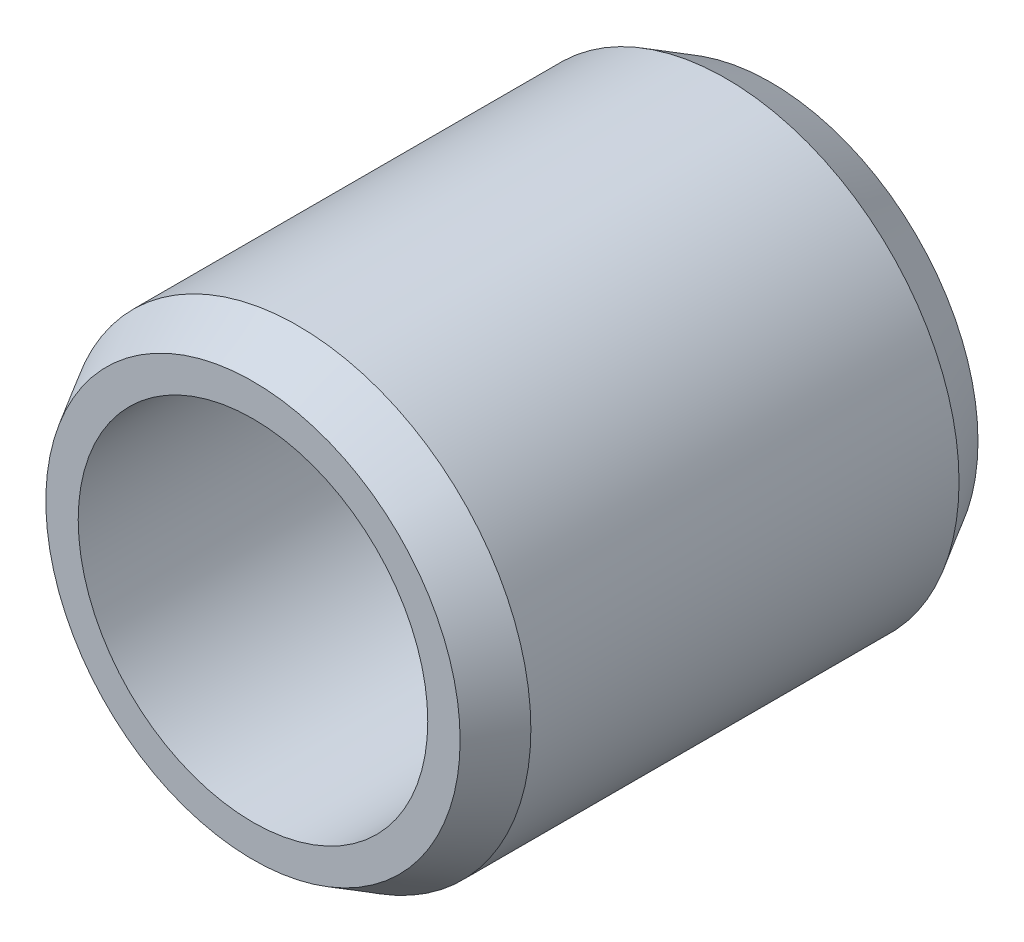
ISO-10303-21;
HEADER;
FILE_DESCRIPTION(('STEP AP214'),'2;1');
FILE_NAME('part.step','',(''),(''),'','','');
FILE_SCHEMA(('AUTOMOTIVE_DESIGN { 1 0 10303 214 1 1 1 1 }'));
ENDSEC;
DATA;
#1=APPLICATION_CONTEXT('core data for automotive mechanical design processes');
#2=APPLICATION_PROTOCOL_DEFINITION('international standard','automotive_design',2000,#1);
#3=PRODUCT_CONTEXT('',#1,'mechanical');
#4=PRODUCT('Part','Part','',(#3));
#5=PRODUCT_RELATED_PRODUCT_CATEGORY('part','',(#4));
#6=PRODUCT_DEFINITION_FORMATION('','',#4);
#7=PRODUCT_DEFINITION_CONTEXT('part definition',#1,'design');
#8=PRODUCT_DEFINITION('design','',#6,#7);
#9=PRODUCT_DEFINITION_SHAPE('','',#8);
#10=(LENGTH_UNIT() NAMED_UNIT(*) SI_UNIT(.MILLI.,.METRE.));
#11=(NAMED_UNIT(*) PLANE_ANGLE_UNIT() SI_UNIT($,.RADIAN.));
#12=(NAMED_UNIT(*) SI_UNIT($,.STERADIAN.) SOLID_ANGLE_UNIT());
#13=UNCERTAINTY_MEASURE_WITH_UNIT(LENGTH_MEASURE(1.E-05),#10,'distance_accuracy_value','');
#14=(GEOMETRIC_REPRESENTATION_CONTEXT(3) GLOBAL_UNCERTAINTY_ASSIGNED_CONTEXT((#13)) GLOBAL_UNIT_ASSIGNED_CONTEXT((#10,
#11,#12)) REPRESENTATION_CONTEXT('',''));
#15=CARTESIAN_POINT('',(0.,0.,0.));
#16=DIRECTION('',(0.,0.,1.));
#17=DIRECTION('',(1.,0.,0.));
#18=AXIS2_PLACEMENT_3D('',#15,#16,#17);
#19=CARTESIAN_POINT('',(0.,0.,10.));
#20=DIRECTION('',(0.,0.,1.));
#21=DIRECTION('',(1.,0.,0.));
#22=AXIS2_PLACEMENT_3D('',#19,#20,#21);
#23=PLANE('',#22);
#24=CARTESIAN_POINT('',(0.,0.,10.));
#25=DIRECTION('',(0.,0.,1.));
#26=DIRECTION('',(1.,0.,0.));
#27=AXIS2_PLACEMENT_3D('',#24,#25,#26);
#28=CIRCLE('',#27,4.);
#29=CARTESIAN_POINT('',(4.,0.,10.));
#30=VERTEX_POINT('',#29);
#31=EDGE_CURVE('E55',#30,#30,#28,.T.);
#32=ORIENTED_EDGE('',*,*,#31,.T.);
#33=EDGE_LOOP('',(#32));
#34=FACE_BOUND('',#33,.T.);
#35=CARTESIAN_POINT('',(0.,0.,10.));
#36=DIRECTION('',(0.,0.,1.));
#37=DIRECTION('',(1.,0.,0.));
#38=AXIS2_PLACEMENT_3D('',#35,#36,#37);
#39=CIRCLE('',#38,3.375);
#40=CARTESIAN_POINT('',(3.375,0.,10.));
#41=VERTEX_POINT('',#40);
#42=EDGE_CURVE('E60',#41,#41,#39,.T.);
#43=ORIENTED_EDGE('',*,*,#42,.F.);
#44=EDGE_LOOP('',(#43));
#45=FACE_BOUND('',#44,.T.);
#46=ADVANCED_FACE('F39',(#34,#45),#23,.T.);
#47=CARTESIAN_POINT('',(0.,0.,0.));
#48=DIRECTION('',(0.,0.,1.));
#49=DIRECTION('',(1.,0.,0.));
#50=AXIS2_PLACEMENT_3D('',#47,#48,#49);
#51=PLANE('',#50);
#52=CARTESIAN_POINT('',(0.,0.,0.));
#53=DIRECTION('',(0.,0.,1.));
#54=DIRECTION('',(1.,0.,0.));
#55=AXIS2_PLACEMENT_3D('',#52,#53,#54);
#56=CIRCLE('',#55,4.);
#57=CARTESIAN_POINT('',(4.,0.,0.));
#58=VERTEX_POINT('',#57);
#59=EDGE_CURVE('E10',#58,#58,#56,.F.);
#60=ORIENTED_EDGE('',*,*,#59,.T.);
#61=EDGE_LOOP('',(#60));
#62=FACE_BOUND('',#61,.T.);
#63=CARTESIAN_POINT('',(0.,0.,0.));
#64=DIRECTION('',(0.,0.,1.));
#65=DIRECTION('',(1.,0.,0.));
#66=AXIS2_PLACEMENT_3D('',#63,#64,#65);
#67=CIRCLE('',#66,3.375);
#68=CARTESIAN_POINT('',(3.375,0.,0.));
#69=VERTEX_POINT('',#68);
#70=EDGE_CURVE('E61',#69,#69,#67,.T.);
#71=ORIENTED_EDGE('',*,*,#70,.T.);
#72=EDGE_LOOP('',(#71));
#73=FACE_BOUND('',#72,.T.);
#74=ADVANCED_FACE('F71',(#62,#73),#51,.F.);
#75=CARTESIAN_POINT('',(0.,0.,10.));
#76=DIRECTION('',(0.,0.,-1.));
#77=DIRECTION('',(-1.,0.,0.));
#78=AXIS2_PLACEMENT_3D('',#75,#76,#77);
#79=CYLINDRICAL_SURFACE('',#78,4.5);
#80=CARTESIAN_POINT('',(0.,0.,9.13397459621557));
#81=DIRECTION('',(0.,0.,1.));
#82=DIRECTION('',(1.,0.,0.));
#83=AXIS2_PLACEMENT_3D('',#80,#81,#82);
#84=CIRCLE('',#83,4.5);
#85=CARTESIAN_POINT('',(4.5,0.,9.13397459621557));
#86=VERTEX_POINT('',#85);
#87=EDGE_CURVE('E47',#86,#86,#84,.F.);
#88=ORIENTED_EDGE('',*,*,#87,.T.);
#89=EDGE_LOOP('',(#88));
#90=FACE_BOUND('',#89,.T.);
#91=CARTESIAN_POINT('',(0.,0.,0.866025403784438));
#92=DIRECTION('',(0.,0.,1.));
#93=DIRECTION('',(1.,0.,0.));
#94=AXIS2_PLACEMENT_3D('',#91,#92,#93);
#95=CIRCLE('',#94,4.5);
#96=CARTESIAN_POINT('',(4.5,0.,0.866025403784438));
#97=VERTEX_POINT('',#96);
#98=EDGE_CURVE('E51',#97,#97,#95,.T.);
#99=ORIENTED_EDGE('',*,*,#98,.T.);
#100=EDGE_LOOP('',(#99));
#101=FACE_BOUND('',#100,.T.);
#102=ADVANCED_FACE('F78',(#90,#101),#79,.T.);
#103=CARTESIAN_POINT('',(0.,0.,10.));
#104=DIRECTION('',(0.,0.,-1.));
#105=DIRECTION('',(-1.,0.,0.));
#106=AXIS2_PLACEMENT_3D('',#103,#104,#105);
#107=CYLINDRICAL_SURFACE('',#106,3.375);
#108=ORIENTED_EDGE('',*,*,#42,.T.);
#109=EDGE_LOOP('',(#108));
#110=FACE_BOUND('',#109,.T.);
#111=ORIENTED_EDGE('',*,*,#70,.F.);
#112=EDGE_LOOP('',(#111));
#113=FACE_BOUND('',#112,.T.);
#114=ADVANCED_FACE('F67',(#110,#113),#107,.F.);
#115=CARTESIAN_POINT('',(0.,0.,10.));
#116=DIRECTION('',(0.,0.,-1.));
#117=DIRECTION('',(-1.,0.,0.));
#118=AXIS2_PLACEMENT_3D('',#115,#116,#117);
#119=CONICAL_SURFACE('',#118,4.,0.523598775598301);
#120=ORIENTED_EDGE('',*,*,#87,.F.);
#121=EDGE_LOOP('',(#120));
#122=FACE_BOUND('',#121,.T.);
#123=ORIENTED_EDGE('',*,*,#31,.F.);
#124=EDGE_LOOP('',(#123));
#125=FACE_BOUND('',#124,.T.);
#126=ADVANCED_FACE('F84',(#122,#125),#119,.T.);
#127=CARTESIAN_POINT('',(0.,0.,0.866025403784438));
#128=DIRECTION('',(0.,0.,1.));
#129=DIRECTION('',(1.,0.,0.));
#130=AXIS2_PLACEMENT_3D('',#127,#128,#129);
#131=CONICAL_SURFACE('',#130,4.5,0.523598775598301);
#132=ORIENTED_EDGE('',*,*,#59,.F.);
#133=EDGE_LOOP('',(#132));
#134=FACE_BOUND('',#133,.T.);
#135=ORIENTED_EDGE('',*,*,#98,.F.);
#136=EDGE_LOOP('',(#135));
#137=FACE_BOUND('',#136,.T.);
#138=ADVANCED_FACE('F42',(#134,#137),#131,.T.);
#139=CLOSED_SHELL('',(#46,#74,#102,#114,#126,#138));
#140=MANIFOLD_SOLID_BREP('B2',#139);
#141=ADVANCED_BREP_SHAPE_REPRESENTATION('',(#18,#140),#14);
#142=SHAPE_DEFINITION_REPRESENTATION(#9,#141);
ENDSEC;
END-ISO-10303-21;
